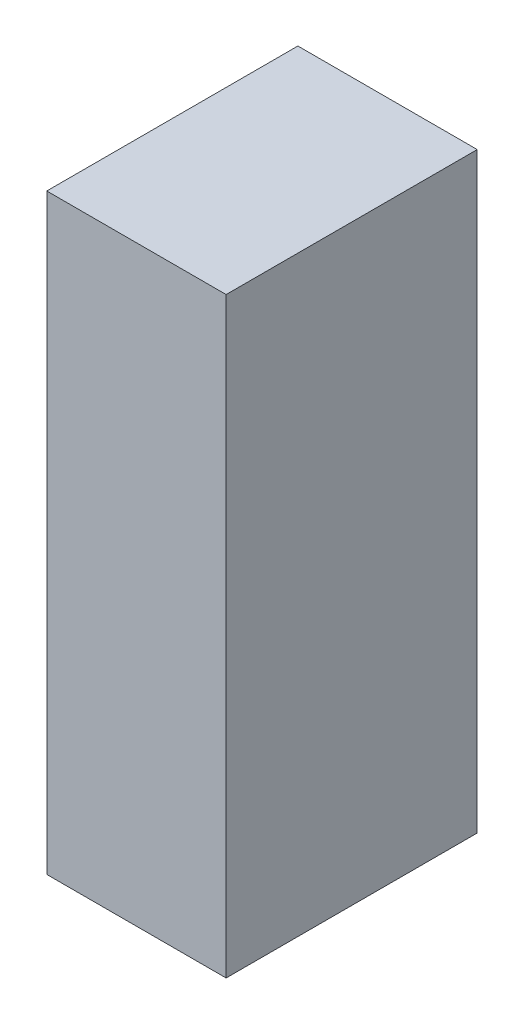
ISO-10303-21;
HEADER;
FILE_DESCRIPTION(('STEP AP214'),'2;1');
FILE_NAME('part.step','',(''),(''),'','','');
FILE_SCHEMA(('AUTOMOTIVE_DESIGN { 1 0 10303 214 1 1 1 1 }'));
ENDSEC;
DATA;
#1=APPLICATION_CONTEXT('core data for automotive mechanical design processes');
#2=APPLICATION_PROTOCOL_DEFINITION('international standard','automotive_design',2000,#1);
#3=PRODUCT_CONTEXT('',#1,'mechanical');
#4=PRODUCT('Part','Part','',(#3));
#5=PRODUCT_RELATED_PRODUCT_CATEGORY('part','',(#4));
#6=PRODUCT_DEFINITION_FORMATION('','',#4);
#7=PRODUCT_DEFINITION_CONTEXT('part definition',#1,'design');
#8=PRODUCT_DEFINITION('design','',#6,#7);
#9=PRODUCT_DEFINITION_SHAPE('','',#8);
#10=(LENGTH_UNIT() NAMED_UNIT(*) SI_UNIT(.MILLI.,.METRE.));
#11=(NAMED_UNIT(*) PLANE_ANGLE_UNIT() SI_UNIT($,.RADIAN.));
#12=(NAMED_UNIT(*) SI_UNIT($,.STERADIAN.) SOLID_ANGLE_UNIT());
#13=UNCERTAINTY_MEASURE_WITH_UNIT(LENGTH_MEASURE(1.E-05),#10,'distance_accuracy_value','');
#14=(GEOMETRIC_REPRESENTATION_CONTEXT(3) GLOBAL_UNCERTAINTY_ASSIGNED_CONTEXT((#13)) GLOBAL_UNIT_ASSIGNED_CONTEXT((#10,
#11,#12)) REPRESENTATION_CONTEXT('',''));
#15=CARTESIAN_POINT('',(0.,0.,0.));
#16=DIRECTION('',(0.,0.,1.));
#17=DIRECTION('',(1.,0.,0.));
#18=AXIS2_PLACEMENT_3D('',#15,#16,#17);
#19=CARTESIAN_POINT('',(-1.62499645258411,-0.82498682007764,-2.84112203121185));
#20=DIRECTION('',(-4.37113882867379E-08,-1.,0.));
#21=DIRECTION('',(1.,-4.37113882867379E-08,0.));
#22=AXIS2_PLACEMENT_3D('',#19,#20,#21);
#23=PLANE('',#22);
#24=DIRECTION('',(0.999999999999999,-4.37113882475976E-08,0.));
#25=VECTOR('',#24,1.);
#26=CARTESIAN_POINT('',(-1.62499645258411,-0.82498682007764,-2.84112203121185));
#27=LINE('',#26,#25);
#28=CARTESIAN_POINT('',(-1.62499645258411,-0.82498682007764,-2.84112203121185));
#29=VERTEX_POINT('',#28);
#30=CARTESIAN_POINT('',(-1.12500408197864,-0.824986841933026,-2.84112203121185));
#31=VERTEX_POINT('',#30);
#32=EDGE_CURVE('E11',#29,#31,#27,.T.);
#33=ORIENTED_EDGE('',*,*,#32,.T.);
#34=DIRECTION('',(0.,0.,1.));
#35=VECTOR('',#34,1.);
#36=CARTESIAN_POINT('',(-1.12500408197864,-0.824986841933001,-2.84112203121185));
#37=LINE('',#36,#35);
#38=CARTESIAN_POINT('',(-1.12500408197864,-0.824986841933026,-2.14112091064453));
#39=VERTEX_POINT('',#38);
#40=EDGE_CURVE('E88',#31,#39,#37,.T.);
#41=ORIENTED_EDGE('',*,*,#40,.T.);
#42=DIRECTION('',(0.999999999999999,-4.37113882475976E-08,0.));
#43=VECTOR('',#42,1.);
#44=CARTESIAN_POINT('',(-1.62499645258411,-0.82498682007764,-2.14112091064453));
#45=LINE('',#44,#43);
#46=CARTESIAN_POINT('',(-1.62499645258411,-0.82498682007764,-2.14112091064453));
#47=VERTEX_POINT('',#46);
#48=EDGE_CURVE('E83',#47,#39,#45,.T.);
#49=ORIENTED_EDGE('',*,*,#48,.F.);
#50=DIRECTION('',(0.,0.,1.));
#51=VECTOR('',#50,1.);
#52=CARTESIAN_POINT('',(-1.62499645258411,-0.82498682007764,-2.84112203121185));
#53=LINE('',#52,#51);
#54=EDGE_CURVE('E72',#29,#47,#53,.T.);
#55=ORIENTED_EDGE('',*,*,#54,.F.);
#56=EDGE_LOOP('',(#33,#41,#49,#55));
#57=FACE_BOUND('',#56,.T.);
#58=ADVANCED_FACE('F17',(#57),#23,.T.);
#59=CARTESIAN_POINT('',(-1.12500408197864,-0.824986841933026,-2.84112203121185));
#60=DIRECTION('',(1.,-4.37113882867379E-08,0.));
#61=DIRECTION('',(4.37113882867379E-08,1.,0.));
#62=AXIS2_PLACEMENT_3D('',#59,#60,#61);
#63=PLANE('',#62);
#64=DIRECTION('',(4.37113882503349E-08,0.999999999999999,0.));
#65=VECTOR('',#64,1.);
#66=CARTESIAN_POINT('',(-1.12500408197864,-0.824986841933026,-2.84112203121185));
#67=LINE('',#66,#65);
#68=CARTESIAN_POINT('',(-1.12500400985512,0.82500705455135,-2.84112203121185));
#69=VERTEX_POINT('',#68);
#70=EDGE_CURVE('E24',#31,#69,#67,.T.);
#71=ORIENTED_EDGE('',*,*,#70,.T.);
#72=DIRECTION('',(0.,0.,1.));
#73=VECTOR('',#72,1.);
#74=CARTESIAN_POINT('',(-1.12500400985512,0.825007054551349,-2.84112203121185));
#75=LINE('',#74,#73);
#76=CARTESIAN_POINT('',(-1.12500400985512,0.82500705455135,-2.14112091064453));
#77=VERTEX_POINT('',#76);
#78=EDGE_CURVE('E85',#69,#77,#75,.T.);
#79=ORIENTED_EDGE('',*,*,#78,.T.);
#80=DIRECTION('',(4.37113882503349E-08,0.999999999999999,0.));
#81=VECTOR('',#80,1.);
#82=CARTESIAN_POINT('',(-1.12500408197864,-0.824986841933026,-2.14112091064453));
#83=LINE('',#82,#81);
#84=EDGE_CURVE('E66',#39,#77,#83,.T.);
#85=ORIENTED_EDGE('',*,*,#84,.F.);
#86=ORIENTED_EDGE('',*,*,#40,.F.);
#87=EDGE_LOOP('',(#71,#79,#85,#86));
#88=FACE_BOUND('',#87,.T.);
#89=ADVANCED_FACE('F89',(#88),#63,.T.);
#90=CARTESIAN_POINT('',(-1.12500400985512,0.82500705455135,-2.84112203121185));
#91=DIRECTION('',(4.37113882867379E-08,1.,0.));
#92=DIRECTION('',(-1.,4.37113882867379E-08,0.));
#93=AXIS2_PLACEMENT_3D('',#90,#91,#92);
#94=PLANE('',#93);
#95=DIRECTION('',(-0.999999999999999,4.37113882475976E-08,0.));
#96=VECTOR('',#95,1.);
#97=CARTESIAN_POINT('',(-1.12500400985512,0.82500705455135,-2.84112203121185));
#98=LINE('',#97,#96);
#99=CARTESIAN_POINT('',(-1.62499638046059,0.825007076406735,-2.84112203121185));
#100=VERTEX_POINT('',#99);
#101=EDGE_CURVE('E62',#69,#100,#98,.T.);
#102=ORIENTED_EDGE('',*,*,#101,.T.);
#103=DIRECTION('',(0.,0.,1.));
#104=VECTOR('',#103,1.);
#105=CARTESIAN_POINT('',(-1.62499638046059,0.82500707640671,-2.84112203121185));
#106=LINE('',#105,#104);
#107=CARTESIAN_POINT('',(-1.62499638046059,0.825007076406735,-2.14112091064453));
#108=VERTEX_POINT('',#107);
#109=EDGE_CURVE('E55',#100,#108,#106,.T.);
#110=ORIENTED_EDGE('',*,*,#109,.T.);
#111=DIRECTION('',(-0.999999999999999,4.37113882475976E-08,0.));
#112=VECTOR('',#111,1.);
#113=CARTESIAN_POINT('',(-1.12500400985512,0.82500705455135,-2.14112091064453));
#114=LINE('',#113,#112);
#115=EDGE_CURVE('E59',#77,#108,#114,.T.);
#116=ORIENTED_EDGE('',*,*,#115,.F.);
#117=ORIENTED_EDGE('',*,*,#78,.F.);
#118=EDGE_LOOP('',(#102,#110,#116,#117));
#119=FACE_BOUND('',#118,.T.);
#120=ADVANCED_FACE('F57',(#119),#94,.T.);
#121=CARTESIAN_POINT('',(-1.62499638046059,0.825007076406735,-2.84112203121185));
#122=DIRECTION('',(-1.,4.37113882867379E-08,0.));
#123=DIRECTION('',(-4.37113882867379E-08,-1.,0.));
#124=AXIS2_PLACEMENT_3D('',#121,#122,#123);
#125=PLANE('',#124);
#126=DIRECTION('',(-4.37113882503349E-08,-0.999999999999999,0.));
#127=VECTOR('',#126,1.);
#128=CARTESIAN_POINT('',(-1.62499638046059,0.825007076406735,-2.84112203121185));
#129=LINE('',#128,#127);
#130=EDGE_CURVE('E65',#100,#29,#129,.T.);
#131=ORIENTED_EDGE('',*,*,#130,.T.);
#132=ORIENTED_EDGE('',*,*,#54,.T.);
#133=DIRECTION('',(-4.37113882503349E-08,-0.999999999999999,0.));
#134=VECTOR('',#133,1.);
#135=CARTESIAN_POINT('',(-1.62499638046059,0.825007076406735,-2.14112091064453));
#136=LINE('',#135,#134);
#137=EDGE_CURVE('E70',#108,#47,#136,.T.);
#138=ORIENTED_EDGE('',*,*,#137,.F.);
#139=ORIENTED_EDGE('',*,*,#109,.F.);
#140=EDGE_LOOP('',(#131,#132,#138,#139));
#141=FACE_BOUND('',#140,.T.);
#142=ADVANCED_FACE('F71',(#141),#125,.T.);
#143=CARTESIAN_POINT('',(-118.999992370605,267.100006103516,-2.14112091064453));
#144=DIRECTION('',(0.,0.,1.));
#145=DIRECTION('',(-4.37113882867379E-08,-1.,0.));
#146=AXIS2_PLACEMENT_3D('',#143,#144,#145);
#147=PLANE('',#146);
#148=ORIENTED_EDGE('',*,*,#48,.T.);
#149=ORIENTED_EDGE('',*,*,#84,.T.);
#150=ORIENTED_EDGE('',*,*,#115,.T.);
#151=ORIENTED_EDGE('',*,*,#137,.T.);
#152=EDGE_LOOP('',(#148,#149,#150,#151));
#153=FACE_BOUND('',#152,.T.);
#154=ADVANCED_FACE('F76',(#153),#147,.T.);
#155=CARTESIAN_POINT('',(-118.999992370605,267.100006103516,-2.84112203121185));
#156=DIRECTION('',(0.,0.,1.));
#157=DIRECTION('',(-4.37113882867379E-08,-1.,0.));
#158=AXIS2_PLACEMENT_3D('',#155,#156,#157);
#159=PLANE('',#158);
#160=ORIENTED_EDGE('',*,*,#130,.F.);
#161=ORIENTED_EDGE('',*,*,#101,.F.);
#162=ORIENTED_EDGE('',*,*,#70,.F.);
#163=ORIENTED_EDGE('',*,*,#32,.F.);
#164=EDGE_LOOP('',(#160,#161,#162,#163));
#165=FACE_BOUND('',#164,.T.);
#166=ADVANCED_FACE('F91',(#165),#159,.F.);
#167=CLOSED_SHELL('',(#58,#89,#120,#142,#154,#166));
#168=MANIFOLD_SOLID_BREP('B1',#167);
#169=ADVANCED_BREP_SHAPE_REPRESENTATION('',(#18,#168),#14);
#170=SHAPE_DEFINITION_REPRESENTATION(#9,#169);
ENDSEC;
END-ISO-10303-21;
